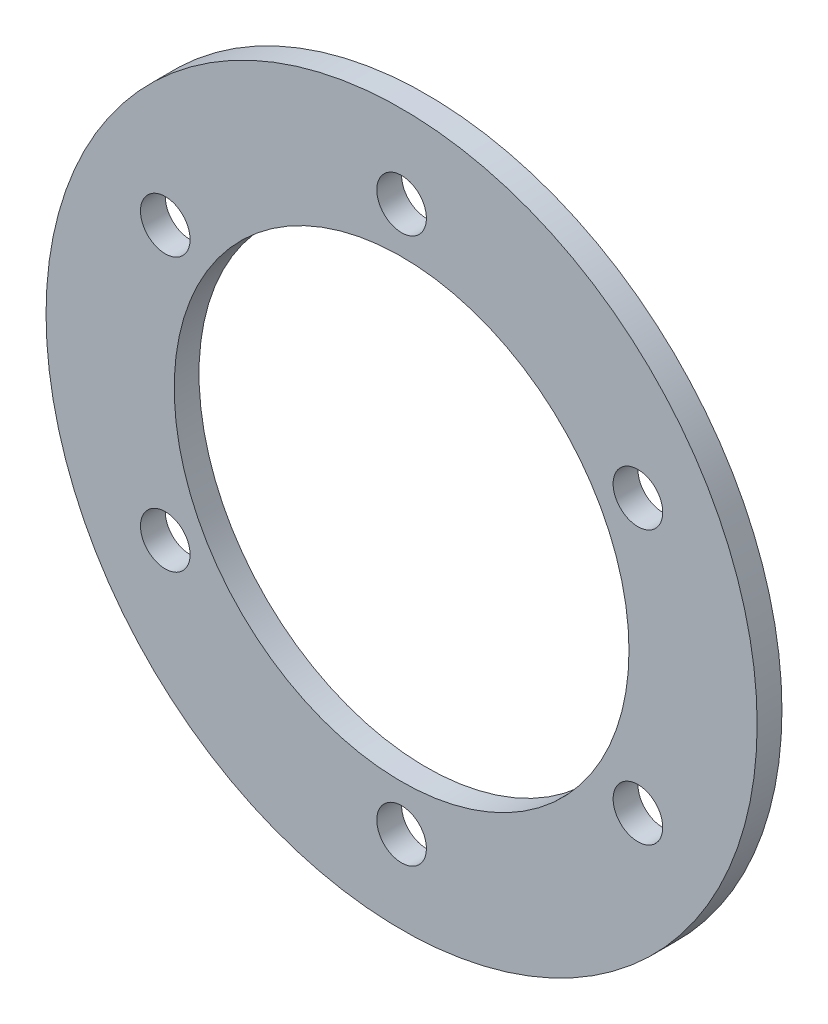
ISO-10303-21;
HEADER;
FILE_DESCRIPTION(('STEP AP214'),'2;1');
FILE_NAME('part.step','',(''),(''),'','','');
FILE_SCHEMA(('AUTOMOTIVE_DESIGN { 1 0 10303 214 1 1 1 1 }'));
ENDSEC;
DATA;
#1=APPLICATION_CONTEXT('core data for automotive mechanical design processes');
#2=APPLICATION_PROTOCOL_DEFINITION('international standard','automotive_design',2000,#1);
#3=PRODUCT_CONTEXT('',#1,'mechanical');
#4=PRODUCT('Part','Part','',(#3));
#5=PRODUCT_RELATED_PRODUCT_CATEGORY('part','',(#4));
#6=PRODUCT_DEFINITION_FORMATION('','',#4);
#7=PRODUCT_DEFINITION_CONTEXT('part definition',#1,'design');
#8=PRODUCT_DEFINITION('design','',#6,#7);
#9=PRODUCT_DEFINITION_SHAPE('','',#8);
#10=(LENGTH_UNIT() NAMED_UNIT(*) SI_UNIT(.MILLI.,.METRE.));
#11=(NAMED_UNIT(*) PLANE_ANGLE_UNIT() SI_UNIT($,.RADIAN.));
#12=(NAMED_UNIT(*) SI_UNIT($,.STERADIAN.) SOLID_ANGLE_UNIT());
#13=UNCERTAINTY_MEASURE_WITH_UNIT(LENGTH_MEASURE(1.E-05),#10,'distance_accuracy_value','');
#14=(GEOMETRIC_REPRESENTATION_CONTEXT(3) GLOBAL_UNCERTAINTY_ASSIGNED_CONTEXT((#13)) GLOBAL_UNIT_ASSIGNED_CONTEXT((#10,
#11,#12)) REPRESENTATION_CONTEXT('',''));
#15=CARTESIAN_POINT('',(0.,0.,0.));
#16=DIRECTION('',(0.,0.,1.));
#17=DIRECTION('',(1.,0.,0.));
#18=AXIS2_PLACEMENT_3D('',#15,#16,#17);
#19=CARTESIAN_POINT('',(0.,0.,3.));
#20=DIRECTION('',(0.,0.,-1.));
#21=DIRECTION('',(-1.,0.,0.));
#22=AXIS2_PLACEMENT_3D('',#19,#20,#21);
#23=CYLINDRICAL_SURFACE('',#22,43.);
#24=CARTESIAN_POINT('',(0.,0.,3.));
#25=DIRECTION('',(0.,0.,1.));
#26=DIRECTION('',(1.,0.,0.));
#27=AXIS2_PLACEMENT_3D('',#24,#25,#26);
#28=CIRCLE('',#27,43.);
#29=CARTESIAN_POINT('',(43.,0.,3.));
#30=VERTEX_POINT('',#29);
#31=EDGE_CURVE('E10',#30,#30,#28,.T.);
#32=ORIENTED_EDGE('',*,*,#31,.F.);
#33=EDGE_LOOP('',(#32));
#34=FACE_BOUND('',#33,.T.);
#35=CARTESIAN_POINT('',(0.,0.,0.));
#36=DIRECTION('',(0.,0.,1.));
#37=DIRECTION('',(1.,0.,0.));
#38=AXIS2_PLACEMENT_3D('',#35,#36,#37);
#39=CIRCLE('',#38,43.);
#40=CARTESIAN_POINT('',(43.,0.,0.));
#41=VERTEX_POINT('',#40);
#42=EDGE_CURVE('E35',#41,#41,#39,.T.);
#43=ORIENTED_EDGE('',*,*,#42,.T.);
#44=EDGE_LOOP('',(#43));
#45=FACE_BOUND('',#44,.T.);
#46=ADVANCED_FACE('F32',(#34,#45),#23,.T.);
#47=CARTESIAN_POINT('',(0.,0.,3.));
#48=DIRECTION('',(0.,0.,1.));
#49=DIRECTION('',(1.,0.,0.));
#50=AXIS2_PLACEMENT_3D('',#47,#48,#49);
#51=PLANE('',#50);
#52=CARTESIAN_POINT('',(0.,0.,3.));
#53=DIRECTION('',(0.,0.,1.));
#54=DIRECTION('',(1.,0.,0.));
#55=AXIS2_PLACEMENT_3D('',#52,#53,#54);
#56=CIRCLE('',#55,27.5);
#57=CARTESIAN_POINT('',(27.5,0.,3.));
#58=VERTEX_POINT('',#57);
#59=EDGE_CURVE('E60',#58,#58,#56,.T.);
#60=ORIENTED_EDGE('',*,*,#59,.F.);
#61=EDGE_LOOP('',(#60));
#62=FACE_BOUND('',#61,.T.);
#63=CARTESIAN_POINT('',(28.5788383248863,16.5000000000003,3.));
#64=DIRECTION('',(0.,0.,1.));
#65=DIRECTION('',(0.50000000000001,-0.866025403784433,0.));
#66=AXIS2_PLACEMENT_3D('',#63,#64,#65);
#67=CIRCLE('',#66,3.);
#68=CARTESIAN_POINT('',(30.0788383248863,13.901923788647,3.));
#69=VERTEX_POINT('',#68);
#70=EDGE_CURVE('E59',#69,#69,#67,.T.);
#71=ORIENTED_EDGE('',*,*,#70,.F.);
#72=EDGE_LOOP('',(#71));
#73=FACE_BOUND('',#72,.T.);
#74=CARTESIAN_POINT('',(28.5788383248866,-16.4999999999997,3.));
#75=DIRECTION('',(0.,0.,1.));
#76=DIRECTION('',(-0.499999999999992,-0.866025403784443,0.));
#77=AXIS2_PLACEMENT_3D('',#74,#75,#76);
#78=CIRCLE('',#77,3.);
#79=CARTESIAN_POINT('',(27.0788383248867,-19.0980762113531,3.));
#80=VERTEX_POINT('',#79);
#81=EDGE_CURVE('E66',#80,#80,#78,.T.);
#82=ORIENTED_EDGE('',*,*,#81,.F.);
#83=EDGE_LOOP('',(#82));
#84=FACE_BOUND('',#83,.T.);
#85=CARTESIAN_POINT('',(0.,-33.,3.));
#86=DIRECTION('',(0.,0.,1.));
#87=DIRECTION('',(-1.,0.,0.));
#88=AXIS2_PLACEMENT_3D('',#85,#86,#87);
#89=CIRCLE('',#88,3.);
#90=CARTESIAN_POINT('',(-3.,-33.,3.));
#91=VERTEX_POINT('',#90);
#92=EDGE_CURVE('E72',#91,#91,#89,.T.);
#93=ORIENTED_EDGE('',*,*,#92,.F.);
#94=EDGE_LOOP('',(#93));
#95=FACE_BOUND('',#94,.T.);
#96=CARTESIAN_POINT('',(-28.5788383248864,-16.5000000000001,3.));
#97=DIRECTION('',(0.,0.,1.));
#98=DIRECTION('',(-0.500000000000004,0.866025403784436,0.));
#99=AXIS2_PLACEMENT_3D('',#96,#97,#98);
#100=CIRCLE('',#99,3.);
#101=CARTESIAN_POINT('',(-30.0788383248864,-13.9019237886468,3.));
#102=VERTEX_POINT('',#101);
#103=EDGE_CURVE('E53',#102,#102,#100,.T.);
#104=ORIENTED_EDGE('',*,*,#103,.F.);
#105=EDGE_LOOP('',(#104));
#106=FACE_BOUND('',#105,.T.);
#107=CARTESIAN_POINT('',(-28.5788383248865,16.4999999999999,3.));
#108=DIRECTION('',(0.,0.,1.));
#109=DIRECTION('',(0.499999999999998,0.86602540378444,0.));
#110=AXIS2_PLACEMENT_3D('',#107,#108,#109);
#111=CIRCLE('',#110,3.);
#112=CARTESIAN_POINT('',(-27.0788383248865,19.0980762113533,3.));
#113=VERTEX_POINT('',#112);
#114=EDGE_CURVE('E47',#113,#113,#111,.T.);
#115=ORIENTED_EDGE('',*,*,#114,.F.);
#116=EDGE_LOOP('',(#115));
#117=FACE_BOUND('',#116,.T.);
#118=CARTESIAN_POINT('',(0.,33.,3.));
#119=DIRECTION('',(0.,0.,1.));
#120=DIRECTION('',(1.,0.,0.));
#121=AXIS2_PLACEMENT_3D('',#118,#119,#120);
#122=CIRCLE('',#121,3.);
#123=CARTESIAN_POINT('',(3.,33.,3.));
#124=VERTEX_POINT('',#123);
#125=EDGE_CURVE('E42',#124,#124,#122,.T.);
#126=ORIENTED_EDGE('',*,*,#125,.F.);
#127=EDGE_LOOP('',(#126));
#128=FACE_BOUND('',#127,.T.);
#129=ORIENTED_EDGE('',*,*,#31,.T.);
#130=EDGE_LOOP('',(#129));
#131=FACE_BOUND('',#130,.T.);
#132=ADVANCED_FACE('F89',(#62,#73,#84,#95,#106,#117,#128,#131),#51,.T.);
#133=CARTESIAN_POINT('',(0.,0.,0.));
#134=DIRECTION('',(0.,0.,1.));
#135=DIRECTION('',(1.,0.,0.));
#136=AXIS2_PLACEMENT_3D('',#133,#134,#135);
#137=PLANE('',#136);
#138=CARTESIAN_POINT('',(0.,0.,0.));
#139=DIRECTION('',(0.,0.,1.));
#140=DIRECTION('',(1.,0.,0.));
#141=AXIS2_PLACEMENT_3D('',#138,#139,#140);
#142=CIRCLE('',#141,27.5);
#143=CARTESIAN_POINT('',(27.5,0.,0.));
#144=VERTEX_POINT('',#143);
#145=EDGE_CURVE('E80',#144,#144,#142,.T.);
#146=ORIENTED_EDGE('',*,*,#145,.T.);
#147=EDGE_LOOP('',(#146));
#148=FACE_BOUND('',#147,.T.);
#149=CARTESIAN_POINT('',(28.5788383248863,16.5000000000003,0.));
#150=DIRECTION('',(0.,0.,1.));
#151=DIRECTION('',(0.50000000000001,-0.866025403784433,0.));
#152=AXIS2_PLACEMENT_3D('',#149,#150,#151);
#153=CIRCLE('',#152,3.);
#154=CARTESIAN_POINT('',(30.0788383248863,13.901923788647,0.));
#155=VERTEX_POINT('',#154);
#156=EDGE_CURVE('E56',#155,#155,#153,.T.);
#157=ORIENTED_EDGE('',*,*,#156,.T.);
#158=EDGE_LOOP('',(#157));
#159=FACE_BOUND('',#158,.T.);
#160=CARTESIAN_POINT('',(28.5788383248866,-16.4999999999997,0.));
#161=DIRECTION('',(0.,0.,1.));
#162=DIRECTION('',(-0.499999999999992,-0.866025403784443,0.));
#163=AXIS2_PLACEMENT_3D('',#160,#161,#162);
#164=CIRCLE('',#163,3.);
#165=CARTESIAN_POINT('',(27.0788383248867,-19.0980762113531,0.));
#166=VERTEX_POINT('',#165);
#167=EDGE_CURVE('E63',#166,#166,#164,.T.);
#168=ORIENTED_EDGE('',*,*,#167,.T.);
#169=EDGE_LOOP('',(#168));
#170=FACE_BOUND('',#169,.T.);
#171=CARTESIAN_POINT('',(0.,-33.,0.));
#172=DIRECTION('',(0.,0.,1.));
#173=DIRECTION('',(-1.,0.,0.));
#174=AXIS2_PLACEMENT_3D('',#171,#172,#173);
#175=CIRCLE('',#174,3.);
#176=CARTESIAN_POINT('',(-3.,-33.,0.));
#177=VERTEX_POINT('',#176);
#178=EDGE_CURVE('E69',#177,#177,#175,.T.);
#179=ORIENTED_EDGE('',*,*,#178,.T.);
#180=EDGE_LOOP('',(#179));
#181=FACE_BOUND('',#180,.T.);
#182=CARTESIAN_POINT('',(-28.5788383248864,-16.5000000000001,0.));
#183=DIRECTION('',(0.,0.,1.));
#184=DIRECTION('',(-0.500000000000004,0.866025403784436,0.));
#185=AXIS2_PLACEMENT_3D('',#182,#183,#184);
#186=CIRCLE('',#185,3.);
#187=CARTESIAN_POINT('',(-30.0788383248864,-13.9019237886468,0.));
#188=VERTEX_POINT('',#187);
#189=EDGE_CURVE('E75',#188,#188,#186,.T.);
#190=ORIENTED_EDGE('',*,*,#189,.T.);
#191=EDGE_LOOP('',(#190));
#192=FACE_BOUND('',#191,.T.);
#193=CARTESIAN_POINT('',(-28.5788383248865,16.4999999999999,0.));
#194=DIRECTION('',(0.,0.,1.));
#195=DIRECTION('',(0.499999999999998,0.86602540378444,0.));
#196=AXIS2_PLACEMENT_3D('',#193,#194,#195);
#197=CIRCLE('',#196,3.);
#198=CARTESIAN_POINT('',(-27.0788383248865,19.0980762113533,0.));
#199=VERTEX_POINT('',#198);
#200=EDGE_CURVE('E50',#199,#199,#197,.T.);
#201=ORIENTED_EDGE('',*,*,#200,.T.);
#202=EDGE_LOOP('',(#201));
#203=FACE_BOUND('',#202,.T.);
#204=CARTESIAN_POINT('',(0.,33.,0.));
#205=DIRECTION('',(0.,0.,1.));
#206=DIRECTION('',(1.,0.,0.));
#207=AXIS2_PLACEMENT_3D('',#204,#205,#206);
#208=CIRCLE('',#207,3.);
#209=CARTESIAN_POINT('',(3.,33.,0.));
#210=VERTEX_POINT('',#209);
#211=EDGE_CURVE('E44',#210,#210,#208,.T.);
#212=ORIENTED_EDGE('',*,*,#211,.T.);
#213=EDGE_LOOP('',(#212));
#214=FACE_BOUND('',#213,.T.);
#215=ORIENTED_EDGE('',*,*,#42,.F.);
#216=EDGE_LOOP('',(#215));
#217=FACE_BOUND('',#216,.T.);
#218=ADVANCED_FACE('F92',(#148,#159,#170,#181,#192,#203,#214,#217),#137,.F.);
#219=CARTESIAN_POINT('',(0.,33.,3.));
#220=DIRECTION('',(0.,0.,-1.));
#221=DIRECTION('',(-1.,0.,0.));
#222=AXIS2_PLACEMENT_3D('',#219,#220,#221);
#223=CYLINDRICAL_SURFACE('',#222,3.);
#224=ORIENTED_EDGE('',*,*,#125,.T.);
#225=EDGE_LOOP('',(#224));
#226=FACE_BOUND('',#225,.T.);
#227=ORIENTED_EDGE('',*,*,#211,.F.);
#228=EDGE_LOOP('',(#227));
#229=FACE_BOUND('',#228,.T.);
#230=ADVANCED_FACE('F106',(#226,#229),#223,.F.);
#231=CARTESIAN_POINT('',(-28.5788383248865,16.4999999999999,3.));
#232=DIRECTION('',(0.,0.,-1.));
#233=DIRECTION('',(-1.,0.,0.));
#234=AXIS2_PLACEMENT_3D('',#231,#232,#233);
#235=CYLINDRICAL_SURFACE('',#234,3.);
#236=ORIENTED_EDGE('',*,*,#114,.T.);
#237=EDGE_LOOP('',(#236));
#238=FACE_BOUND('',#237,.T.);
#239=ORIENTED_EDGE('',*,*,#200,.F.);
#240=EDGE_LOOP('',(#239));
#241=FACE_BOUND('',#240,.T.);
#242=ADVANCED_FACE('F109',(#238,#241),#235,.F.);
#243=CARTESIAN_POINT('',(-28.5788383248864,-16.5000000000001,3.));
#244=DIRECTION('',(0.,0.,-1.));
#245=DIRECTION('',(-1.,0.,0.));
#246=AXIS2_PLACEMENT_3D('',#243,#244,#245);
#247=CYLINDRICAL_SURFACE('',#246,3.);
#248=ORIENTED_EDGE('',*,*,#103,.T.);
#249=EDGE_LOOP('',(#248));
#250=FACE_BOUND('',#249,.T.);
#251=ORIENTED_EDGE('',*,*,#189,.F.);
#252=EDGE_LOOP('',(#251));
#253=FACE_BOUND('',#252,.T.);
#254=ADVANCED_FACE('F142',(#250,#253),#247,.F.);
#255=CARTESIAN_POINT('',(0.,-33.,3.));
#256=DIRECTION('',(0.,0.,-1.));
#257=DIRECTION('',(-1.,0.,0.));
#258=AXIS2_PLACEMENT_3D('',#255,#256,#257);
#259=CYLINDRICAL_SURFACE('',#258,3.);
#260=ORIENTED_EDGE('',*,*,#92,.T.);
#261=EDGE_LOOP('',(#260));
#262=FACE_BOUND('',#261,.T.);
#263=ORIENTED_EDGE('',*,*,#178,.F.);
#264=EDGE_LOOP('',(#263));
#265=FACE_BOUND('',#264,.T.);
#266=ADVANCED_FACE('F150',(#262,#265),#259,.F.);
#267=CARTESIAN_POINT('',(28.5788383248866,-16.4999999999997,3.));
#268=DIRECTION('',(0.,0.,-1.));
#269=DIRECTION('',(-1.,0.,0.));
#270=AXIS2_PLACEMENT_3D('',#267,#268,#269);
#271=CYLINDRICAL_SURFACE('',#270,3.);
#272=ORIENTED_EDGE('',*,*,#81,.T.);
#273=EDGE_LOOP('',(#272));
#274=FACE_BOUND('',#273,.T.);
#275=ORIENTED_EDGE('',*,*,#167,.F.);
#276=EDGE_LOOP('',(#275));
#277=FACE_BOUND('',#276,.T.);
#278=ADVANCED_FACE('F158',(#274,#277),#271,.F.);
#279=CARTESIAN_POINT('',(28.5788383248863,16.5000000000003,3.));
#280=DIRECTION('',(0.,0.,-1.));
#281=DIRECTION('',(-1.,0.,0.));
#282=AXIS2_PLACEMENT_3D('',#279,#280,#281);
#283=CYLINDRICAL_SURFACE('',#282,3.);
#284=ORIENTED_EDGE('',*,*,#70,.T.);
#285=EDGE_LOOP('',(#284));
#286=FACE_BOUND('',#285,.T.);
#287=ORIENTED_EDGE('',*,*,#156,.F.);
#288=EDGE_LOOP('',(#287));
#289=FACE_BOUND('',#288,.T.);
#290=ADVANCED_FACE('F166',(#286,#289),#283,.F.);
#291=CARTESIAN_POINT('',(0.,0.,3.));
#292=DIRECTION('',(0.,0.,-1.));
#293=DIRECTION('',(-1.,0.,0.));
#294=AXIS2_PLACEMENT_3D('',#291,#292,#293);
#295=CYLINDRICAL_SURFACE('',#294,27.5);
#296=ORIENTED_EDGE('',*,*,#59,.T.);
#297=EDGE_LOOP('',(#296));
#298=FACE_BOUND('',#297,.T.);
#299=ORIENTED_EDGE('',*,*,#145,.F.);
#300=EDGE_LOOP('',(#299));
#301=FACE_BOUND('',#300,.T.);
#302=ADVANCED_FACE('F86',(#298,#301),#295,.F.);
#303=CLOSED_SHELL('',(#46,#132,#218,#230,#242,#254,#266,#278,#290,#302));
#304=MANIFOLD_SOLID_BREP('B2',#303);
#305=ADVANCED_BREP_SHAPE_REPRESENTATION('',(#18,#304),#14);
#306=SHAPE_DEFINITION_REPRESENTATION(#9,#305);
ENDSEC;
END-ISO-10303-21;
